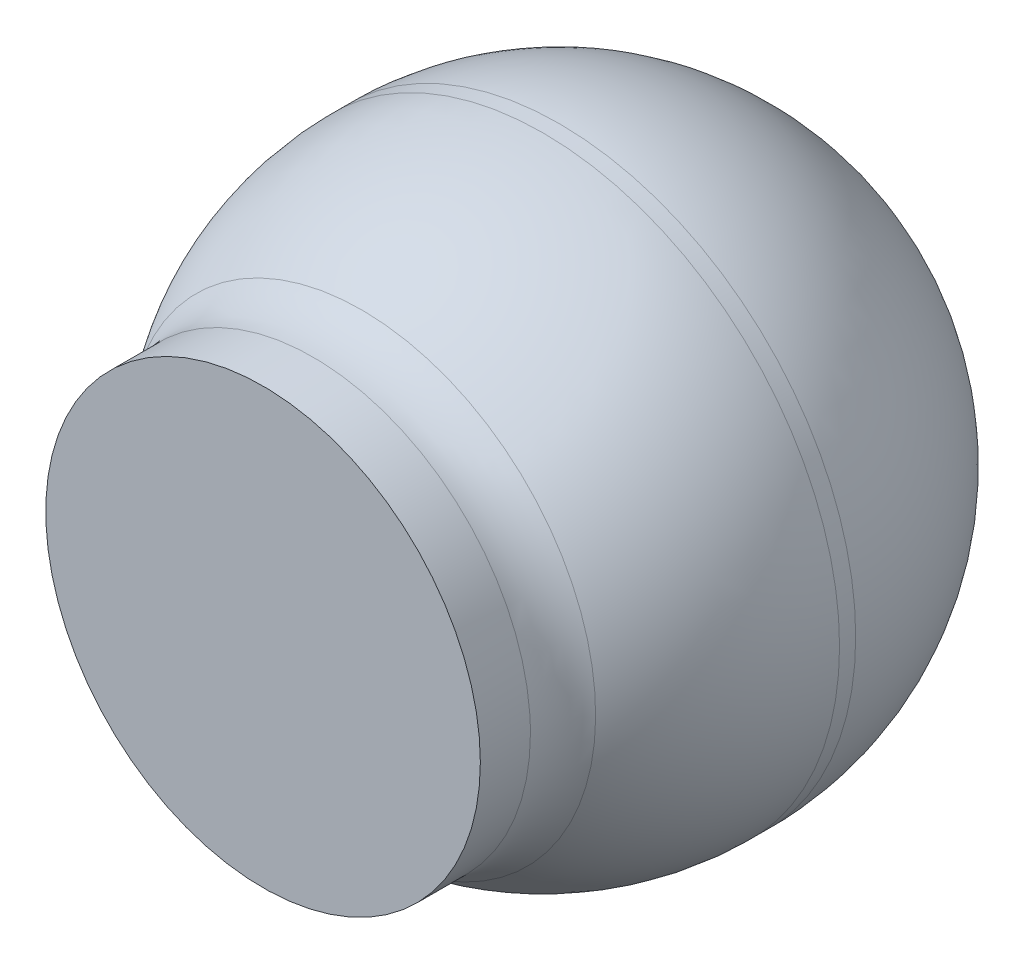
ISO-10303-21;
HEADER;
FILE_DESCRIPTION(('STEP AP214'),'2;1');
FILE_NAME('part.step','',(''),(''),'','','');
FILE_SCHEMA(('AUTOMOTIVE_DESIGN { 1 0 10303 214 1 1 1 1 }'));
ENDSEC;
DATA;
#1=APPLICATION_CONTEXT('core data for automotive mechanical design processes');
#2=APPLICATION_PROTOCOL_DEFINITION('international standard','automotive_design',2000,#1);
#3=PRODUCT_CONTEXT('',#1,'mechanical');
#4=PRODUCT('Part','Part','',(#3));
#5=PRODUCT_RELATED_PRODUCT_CATEGORY('part','',(#4));
#6=PRODUCT_DEFINITION_FORMATION('','',#4);
#7=PRODUCT_DEFINITION_CONTEXT('part definition',#1,'design');
#8=PRODUCT_DEFINITION('design','',#6,#7);
#9=PRODUCT_DEFINITION_SHAPE('','',#8);
#10=(LENGTH_UNIT() NAMED_UNIT(*) SI_UNIT(.MILLI.,.METRE.));
#11=(NAMED_UNIT(*) PLANE_ANGLE_UNIT() SI_UNIT($,.RADIAN.));
#12=(NAMED_UNIT(*) SI_UNIT($,.STERADIAN.) SOLID_ANGLE_UNIT());
#13=UNCERTAINTY_MEASURE_WITH_UNIT(LENGTH_MEASURE(1.E-05),#10,'distance_accuracy_value','');
#14=(GEOMETRIC_REPRESENTATION_CONTEXT(3) GLOBAL_UNCERTAINTY_ASSIGNED_CONTEXT((#13)) GLOBAL_UNIT_ASSIGNED_CONTEXT((#10,
#11,#12)) REPRESENTATION_CONTEXT('',''));
#15=CARTESIAN_POINT('',(0.,0.,0.));
#16=DIRECTION('',(0.,0.,1.));
#17=DIRECTION('',(1.,0.,0.));
#18=AXIS2_PLACEMENT_3D('',#15,#16,#17);
#19=CARTESIAN_POINT('',(-0.562919922269,-5.321349291452,10.006534503384));
#20=DIRECTION('',(0.,0.,-1.));
#21=DIRECTION('',(-1.,0.,0.));
#22=AXIS2_PLACEMENT_3D('',#19,#20,#21);
#23=PLANE('',#22);
#24=CARTESIAN_POINT('',(-0.562919922269,-5.321349291452,10.006534503384));
#25=DIRECTION('',(0.,0.,1.));
#26=DIRECTION('',(1.,0.,0.));
#27=AXIS2_PLACEMENT_3D('',#24,#25,#26);
#28=CIRCLE('',#27,0.275);
#29=CARTESIAN_POINT('',(-0.287919922269,-5.321349291452,10.006534503384));
#30=VERTEX_POINT('',#29);
#31=EDGE_CURVE('E20',#30,#30,#28,.F.);
#32=ORIENTED_EDGE('',*,*,#31,.F.);
#33=EDGE_LOOP('',(#32));
#34=FACE_BOUND('',#33,.T.);
#35=ADVANCED_FACE('F17',(#34),#23,.F.);
#36=CARTESIAN_POINT('',(-0.562919922269,-5.321349291452,9.906534503384));
#37=DIRECTION('',(0.,0.,1.));
#38=DIRECTION('',(1.,0.,0.));
#39=AXIS2_PLACEMENT_3D('',#36,#37,#38);
#40=CYLINDRICAL_SURFACE('',#39,0.275);
#41=CARTESIAN_POINT('',(-0.562919922269,-5.321349291452,9.943180457728));
#42=DIRECTION('',(0.,0.,-1.));
#43=DIRECTION('',(0.996700902337583,0.0811622527992438,0.));
#44=AXIS2_PLACEMENT_3D('',#41,#42,#43);
#45=CIRCLE('',#44,0.275);
#46=CARTESIAN_POINT('',(-0.288827174126165,-5.29902967193221,9.943180457728));
#47=VERTEX_POINT('',#46);
#48=EDGE_CURVE('E65',#47,#47,#45,.F.);
#49=ORIENTED_EDGE('',*,*,#48,.T.);
#50=EDGE_LOOP('',(#49));
#51=FACE_BOUND('',#50,.T.);
#52=ORIENTED_EDGE('',*,*,#31,.T.);
#53=EDGE_LOOP('',(#52));
#54=FACE_BOUND('',#53,.T.);
#55=ADVANCED_FACE('F62',(#51,#54),#40,.T.);
#56=CARTESIAN_POINT('',(-0.562919922269,-5.321349291452,9.943180457728));
#57=DIRECTION('',(0.,0.,-1.));
#58=DIRECTION('',(0.996700902337583,0.0811622527992449,0.));
#59=AXIS2_PLACEMENT_3D('',#56,#57,#58);
#60=TOROIDAL_SURFACE('',#59,0.375,0.1);
#61=ORIENTED_EDGE('',*,*,#48,.F.);
#62=EDGE_LOOP('',(#61));
#63=FACE_BOUND('',#62,.T.);
#64=CARTESIAN_POINT('',(-0.562919922268999,-5.321349291452,9.881744931236));
#65=DIRECTION('',(0.,0.,-1.));
#66=DIRECTION('',(-0.996700902337597,-0.0811622527990622,0.));
#67=AXIS2_PLACEMENT_3D('',#64,#65,#66);
#68=CIRCLE('',#67,0.296097046412665);
#69=CARTESIAN_POINT('',(-0.858040115608,-5.345381194786,9.881744931236));
#70=VERTEX_POINT('',#69);
#71=EDGE_CURVE('E39',#70,#70,#68,.T.);
#72=ORIENTED_EDGE('',*,*,#71,.F.);
#73=EDGE_LOOP('',(#72));
#74=FACE_BOUND('',#73,.T.);
#75=ADVANCED_FACE('F57',(#63,#74),#60,.F.);
#76=CARTESIAN_POINT('',(-0.936682760645,-5.351785136252,9.651976062157));
#77=CARTESIAN_POINT('',(-0.936682760645,-5.351785136252,9.701461392103));
#78=CARTESIAN_POINT('',(-0.928526217348,-5.351120941579,9.750947004335));
#79=CARTESIAN_POINT('',(-0.912207085349,-5.349792059952,9.798626332798));
#80=CARTESIAN_POINT('',(-0.888341390838,-5.347848654938,9.842699544317));
#81=CARTESIAN_POINT('',(-0.858040115608,-5.345381194786,9.881744931236));
#82=(BOUNDED_CURVE() B_SPLINE_CURVE(5,(#76,#77,#78,#79,#80,#81),.UNSPECIFIED.,.F.,
.F.) B_SPLINE_CURVE_WITH_KNOTS((6,6),(0.,0.661568582165),
.UNSPECIFIED.) CURVE() GEOMETRIC_REPRESENTATION_ITEM() RATIONAL_B_SPLINE_CURVE((1.,1.,1.,1.,1.,1.)) REPRESENTATION_ITEM(''));
#83=CARTESIAN_POINT('',(-0.562919922269,-5.321349291452,9.651976062157));
#84=DIRECTION('',(0.,0.,-1.));
#85=AXIS1_PLACEMENT('',#83,#84);
#86=SURFACE_OF_REVOLUTION('',#82,#85);
#87=CARTESIAN_POINT('',(-0.562919922268999,-5.321349291452,9.651976062157));
#88=DIRECTION('',(0.,0.,1.));
#89=DIRECTION('',(1.,0.,0.));
#90=AXIS2_PLACEMENT_3D('',#87,#88,#89);
#91=CIRCLE('',#90,0.375);
#92=CARTESIAN_POINT('',(-0.187919922268999,-5.321349291452,9.651976062157));
#93=VERTEX_POINT('',#92);
#94=EDGE_CURVE('E36',#93,#93,#91,.F.);
#95=ORIENTED_EDGE('',*,*,#94,.F.);
#96=EDGE_LOOP('',(#95));
#97=FACE_BOUND('',#96,.T.);
#98=ORIENTED_EDGE('',*,*,#71,.T.);
#99=EDGE_LOOP('',(#98));
#100=FACE_BOUND('',#99,.T.);
#101=ADVANCED_FACE('F53',(#97,#100),#86,.F.);
#102=CARTESIAN_POINT('',(-0.562919922269,-5.321349291452,9.256534503384));
#103=DIRECTION('',(0.,0.,1.));
#104=DIRECTION('',(1.,0.,0.));
#105=AXIS2_PLACEMENT_3D('',#102,#103,#104);
#106=CYLINDRICAL_SURFACE('',#105,0.375);
#107=CARTESIAN_POINT('',(-0.562919922269,-5.321349291452,9.631534503384));
#108=DIRECTION('',(0.,0.,-1.));
#109=DIRECTION('',(0.0811622527992362,-0.996700902337583,0.));
#110=AXIS2_PLACEMENT_3D('',#107,#108,#109);
#111=CIRCLE('',#110,0.375);
#112=CARTESIAN_POINT('',(-0.532484077469287,-5.69511212982859,9.631534503384));
#113=VERTEX_POINT('',#112);
#114=CARTESIAN_POINT('',(-0.593355767068713,-4.94758645307541,9.631534503384));
#115=VERTEX_POINT('',#114);
#116=EDGE_CURVE('E11',#113,#115,#111,.T.);
#117=ORIENTED_EDGE('',*,*,#116,.F.);
#118=CARTESIAN_POINT('',(-0.562919922269,-5.321349291452,9.631534503384));
#119=DIRECTION('',(0.,0.,1.));
#120=DIRECTION('',(0.0811622527992359,-0.996700902337583,0.));
#121=AXIS2_PLACEMENT_3D('',#118,#119,#120);
#122=CIRCLE('',#121,0.375);
#123=EDGE_CURVE('E25',#115,#113,#122,.F.);
#124=ORIENTED_EDGE('',*,*,#123,.F.);
#125=EDGE_LOOP('',(#117,#124));
#126=FACE_BOUND('',#125,.T.);
#127=ORIENTED_EDGE('',*,*,#94,.T.);
#128=EDGE_LOOP('',(#127));
#129=FACE_BOUND('',#128,.T.);
#130=ADVANCED_FACE('F34',(#126,#129),#106,.T.);
#131=CARTESIAN_POINT('',(-0.562919922269,-5.321349291452,9.631534503384));
#132=DIRECTION('',(0.0811622527992361,-0.996700902337583,0.));
#133=DIRECTION('',(-0.996700902337583,-0.0811622527992361,0.));
#134=AXIS2_PLACEMENT_3D('',#131,#132,#133);
#135=SPHERICAL_SURFACE('',#134,0.375);
#136=ORIENTED_EDGE('',*,*,#123,.T.);
#137=ORIENTED_EDGE('',*,*,#116,.T.);
#138=EDGE_LOOP('',(#136,#137));
#139=FACE_BOUND('',#138,.T.);
#140=ADVANCED_FACE('F32',(#139),#135,.T.);
#141=CLOSED_SHELL('',(#35,#55,#75,#101,#130,#140));
#142=MANIFOLD_SOLID_BREP('B1',#141);
#143=ADVANCED_BREP_SHAPE_REPRESENTATION('',(#18,#142),#14);
#144=SHAPE_DEFINITION_REPRESENTATION(#9,#143);
ENDSEC;
END-ISO-10303-21;
